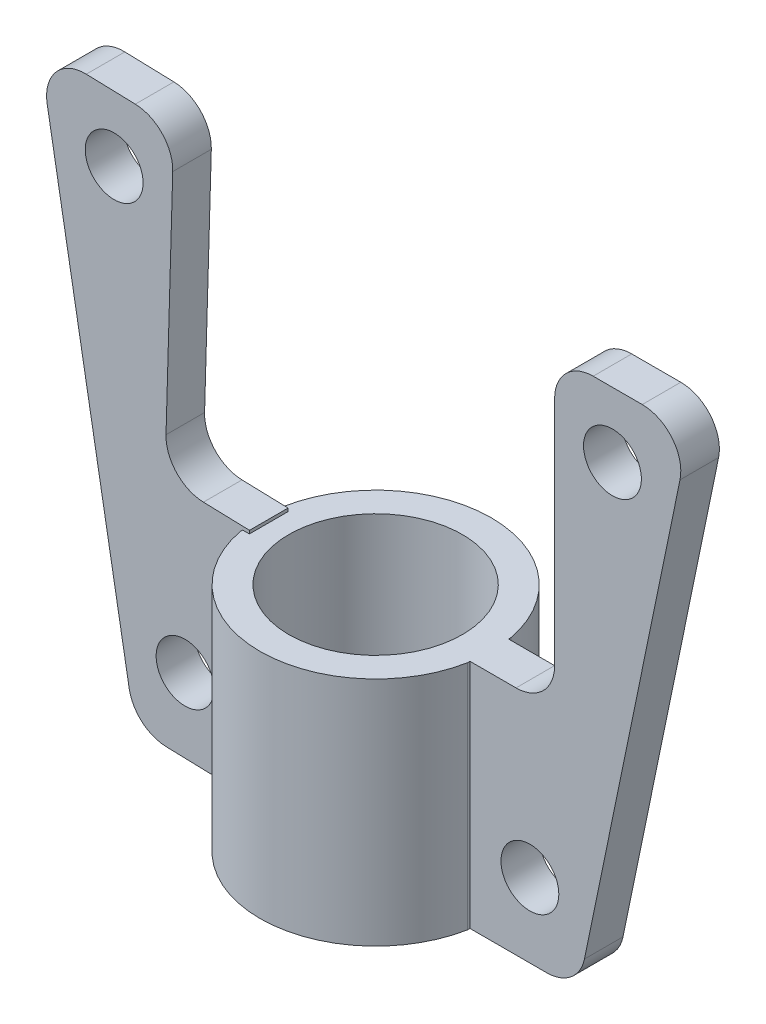
ISO-10303-21;
HEADER;
FILE_DESCRIPTION(('STEP AP214'),'2;1');
FILE_NAME('part.step','',(''),(''),'','','');
FILE_SCHEMA(('AUTOMOTIVE_DESIGN { 1 0 10303 214 1 1 1 1 }'));
ENDSEC;
DATA;
#1=APPLICATION_CONTEXT('core data for automotive mechanical design processes');
#2=APPLICATION_PROTOCOL_DEFINITION('international standard','automotive_design',2000,#1);
#3=PRODUCT_CONTEXT('',#1,'mechanical');
#4=PRODUCT('Part','Part','',(#3));
#5=PRODUCT_RELATED_PRODUCT_CATEGORY('part','',(#4));
#6=PRODUCT_DEFINITION_FORMATION('','',#4);
#7=PRODUCT_DEFINITION_CONTEXT('part definition',#1,'design');
#8=PRODUCT_DEFINITION('design','',#6,#7);
#9=PRODUCT_DEFINITION_SHAPE('','',#8);
#10=(LENGTH_UNIT() NAMED_UNIT(*) SI_UNIT(.MILLI.,.METRE.));
#11=(NAMED_UNIT(*) PLANE_ANGLE_UNIT() SI_UNIT($,.RADIAN.));
#12=(NAMED_UNIT(*) SI_UNIT($,.STERADIAN.) SOLID_ANGLE_UNIT());
#13=UNCERTAINTY_MEASURE_WITH_UNIT(LENGTH_MEASURE(1.E-05),#10,'distance_accuracy_value','');
#14=(GEOMETRIC_REPRESENTATION_CONTEXT(3) GLOBAL_UNCERTAINTY_ASSIGNED_CONTEXT((#13)) GLOBAL_UNIT_ASSIGNED_CONTEXT((#10,
#11,#12)) REPRESENTATION_CONTEXT('',''));
#15=CARTESIAN_POINT('',(0.,0.,0.));
#16=DIRECTION('',(0.,0.,1.));
#17=DIRECTION('',(1.,0.,0.));
#18=AXIS2_PLACEMENT_3D('',#15,#16,#17);
#19=CARTESIAN_POINT('',(29.4646107927976,60.,-5.64240293039713));
#20=DIRECTION('',(-1.,0.,0.));
#21=DIRECTION('',(0.,0.,1.));
#22=AXIS2_PLACEMENT_3D('',#19,#20,#21);
#23=PLANE('',#22);
#24=DIRECTION('',(0.,-1.,0.));
#25=VECTOR('',#24,1.);
#26=CARTESIAN_POINT('',(29.4646107927976,60.,5.));
#27=LINE('',#26,#25);
#28=CARTESIAN_POINT('',(29.4646107927976,60.,5.));
#29=VERTEX_POINT('',#28);
#30=CARTESIAN_POINT('',(29.4646107927976,0.,5.));
#31=VERTEX_POINT('',#30);
#32=EDGE_CURVE('E254',#29,#31,#27,.T.);
#33=ORIENTED_EDGE('',*,*,#32,.F.);
#34=DIRECTION('',(0.,0.,-1.));
#35=VECTOR('',#34,1.);
#36=CARTESIAN_POINT('',(29.4646107927976,60.,-5.64240293039713));
#37=LINE('',#36,#35);
#38=CARTESIAN_POINT('',(29.4646107927976,60.,5.64240293039713));
#39=VERTEX_POINT('',#38);
#40=EDGE_CURVE('E329',#39,#29,#37,.T.);
#41=ORIENTED_EDGE('',*,*,#40,.F.);
#42=DIRECTION('',(0.,-1.,0.));
#43=VECTOR('',#42,1.);
#44=CARTESIAN_POINT('',(29.4646107927976,60.,5.64240293039713));
#45=LINE('',#44,#43);
#46=CARTESIAN_POINT('',(29.4646107927976,0.,5.64240293039713));
#47=VERTEX_POINT('',#46);
#48=EDGE_CURVE('E354',#39,#47,#45,.T.);
#49=ORIENTED_EDGE('',*,*,#48,.T.);
#50=DIRECTION('',(0.,0.,-1.));
#51=VECTOR('',#50,1.);
#52=CARTESIAN_POINT('',(29.4646107927976,0.,-5.64240293039713));
#53=LINE('',#52,#51);
#54=EDGE_CURVE('E341',#47,#31,#53,.T.);
#55=ORIENTED_EDGE('',*,*,#54,.T.);
#56=EDGE_LOOP('',(#33,#41,#49,#55));
#57=FACE_BOUND('',#56,.T.);
#58=ADVANCED_FACE('F33',(#57),#23,.F.);
#59=CARTESIAN_POINT('',(0.,60.,0.));
#60=DIRECTION('',(0.,1.,0.));
#61=DIRECTION('',(0.,0.,1.));
#62=AXIS2_PLACEMENT_3D('',#59,#60,#61);
#63=PLANE('',#62);
#64=DIRECTION('',(1.,0.,0.));
#65=VECTOR('',#64,1.);
#66=CARTESIAN_POINT('',(0.,60.,5.));
#67=LINE('',#66,#65);
#68=CARTESIAN_POINT('',(-29.4646107927976,60.,5.));
#69=VERTEX_POINT('',#68);
#70=CARTESIAN_POINT('',(-27.730616602569,60.,5.));
#71=VERTEX_POINT('',#70);
#72=EDGE_CURVE('E231',#69,#71,#67,.T.);
#73=ORIENTED_EDGE('',*,*,#72,.F.);
#74=DIRECTION('',(0.,0.,1.));
#75=VECTOR('',#74,1.);
#76=CARTESIAN_POINT('',(-29.4646107927976,60.,-5.64240293039713));
#77=LINE('',#76,#75);
#78=CARTESIAN_POINT('',(-29.4646107927976,60.,5.64240293039713));
#79=VERTEX_POINT('',#78);
#80=EDGE_CURVE('E334',#69,#79,#77,.T.);
#81=ORIENTED_EDGE('',*,*,#80,.T.);
#82=CARTESIAN_POINT('',(0.,60.,0.));
#83=DIRECTION('',(0.,1.,0.));
#84=DIRECTION('',(0.,0.,1.));
#85=AXIS2_PLACEMENT_3D('',#82,#83,#84);
#86=CIRCLE('',#85,30.);
#87=EDGE_CURVE('E324',#79,#39,#86,.T.);
#88=ORIENTED_EDGE('',*,*,#87,.T.);
#89=ORIENTED_EDGE('',*,*,#40,.T.);
#90=DIRECTION('',(-1.,0.,0.));
#91=VECTOR('',#90,1.);
#92=CARTESIAN_POINT('',(41.4118199360627,60.,5.));
#93=LINE('',#92,#91);
#94=CARTESIAN_POINT('',(41.4118199360627,60.,5.));
#95=VERTEX_POINT('',#94);
#96=EDGE_CURVE('E251',#95,#29,#93,.T.);
#97=ORIENTED_EDGE('',*,*,#96,.F.);
#98=DIRECTION('',(0.,0.,-1.));
#99=VECTOR('',#98,1.);
#100=CARTESIAN_POINT('',(41.4118199360627,60.,5.));
#101=LINE('',#100,#99);
#102=CARTESIAN_POINT('',(41.4118199360627,60.,-5.));
#103=VERTEX_POINT('',#102);
#104=EDGE_CURVE('E274',#95,#103,#101,.T.);
#105=ORIENTED_EDGE('',*,*,#104,.T.);
#106=DIRECTION('',(-1.,0.,0.));
#107=VECTOR('',#106,1.);
#108=CARTESIAN_POINT('',(41.4118199360627,60.,-5.));
#109=LINE('',#108,#107);
#110=CARTESIAN_POINT('',(29.4646107927976,60.,-5.));
#111=VERTEX_POINT('',#110);
#112=EDGE_CURVE('E248',#103,#111,#109,.T.);
#113=ORIENTED_EDGE('',*,*,#112,.T.);
#114=CARTESIAN_POINT('',(29.4646107927976,60.,-5.64240293039713));
#115=VERTEX_POINT('',#114);
#116=EDGE_CURVE('E327',#111,#115,#37,.T.);
#117=ORIENTED_EDGE('',*,*,#116,.T.);
#118=CARTESIAN_POINT('',(0.,60.,0.));
#119=DIRECTION('',(0.,1.,0.));
#120=DIRECTION('',(0.,0.,1.));
#121=AXIS2_PLACEMENT_3D('',#118,#119,#120);
#122=CIRCLE('',#121,30.);
#123=CARTESIAN_POINT('',(-29.4646107927976,60.,-5.64240293039715));
#124=VERTEX_POINT('',#123);
#125=EDGE_CURVE('E332',#115,#124,#122,.T.);
#126=ORIENTED_EDGE('',*,*,#125,.T.);
#127=CARTESIAN_POINT('',(-29.4646107927976,60.,-5.));
#128=VERTEX_POINT('',#127);
#129=EDGE_CURVE('E335',#124,#128,#77,.T.);
#130=ORIENTED_EDGE('',*,*,#129,.T.);
#131=DIRECTION('',(1.,0.,0.));
#132=VECTOR('',#131,1.);
#133=CARTESIAN_POINT('',(0.,60.,-5.));
#134=LINE('',#133,#132);
#135=CARTESIAN_POINT('',(-27.730616602569,60.,-5.));
#136=VERTEX_POINT('',#135);
#137=EDGE_CURVE('E51',#128,#136,#134,.T.);
#138=ORIENTED_EDGE('',*,*,#137,.T.);
#139=DIRECTION('',(0.,0.,1.));
#140=VECTOR('',#139,1.);
#141=CARTESIAN_POINT('',(-27.730616602569,60.,0.));
#142=LINE('',#141,#140);
#143=EDGE_CURVE('E11',#136,#71,#142,.T.);
#144=ORIENTED_EDGE('',*,*,#143,.T.);
#145=EDGE_LOOP('',(#73,#81,#88,#89,#97,#105,#113,#117,#126,#130,#138,#144));
#146=FACE_BOUND('',#145,.T.);
#147=CARTESIAN_POINT('',(0.,60.,0.));
#148=DIRECTION('',(0.,1.,0.));
#149=DIRECTION('',(0.,0.,1.));
#150=AXIS2_PLACEMENT_3D('',#147,#148,#149);
#151=CIRCLE('',#150,22.5);
#152=CARTESIAN_POINT('',(0.,60.,22.5));
#153=VERTEX_POINT('',#152);
#154=EDGE_CURVE('E318',#153,#153,#151,.T.);
#155=ORIENTED_EDGE('',*,*,#154,.F.);
#156=EDGE_LOOP('',(#155));
#157=FACE_BOUND('',#156,.T.);
#158=ADVANCED_FACE('F452',(#146,#157),#63,.T.);
#159=CARTESIAN_POINT('',(0.,0.,0.));
#160=DIRECTION('',(0.,1.,0.));
#161=DIRECTION('',(0.,0.,1.));
#162=AXIS2_PLACEMENT_3D('',#159,#160,#161);
#163=PLANE('',#162);
#164=CARTESIAN_POINT('',(0.,0.,0.));
#165=DIRECTION('',(0.,1.,0.));
#166=DIRECTION('',(0.,0.,1.));
#167=AXIS2_PLACEMENT_3D('',#164,#165,#166);
#168=CIRCLE('',#167,30.);
#169=CARTESIAN_POINT('',(-29.4646107927976,0.,5.64240293039713));
#170=VERTEX_POINT('',#169);
#171=EDGE_CURVE('E321',#170,#47,#168,.T.);
#172=ORIENTED_EDGE('',*,*,#171,.F.);
#173=DIRECTION('',(0.,0.,1.));
#174=VECTOR('',#173,1.);
#175=CARTESIAN_POINT('',(-29.4646107927976,0.,-5.64240293039713));
#176=LINE('',#175,#174);
#177=CARTESIAN_POINT('',(-29.4646107927976,0.,-5.64240293039715));
#178=VERTEX_POINT('',#177);
#179=EDGE_CURVE('E328',#178,#170,#176,.T.);
#180=ORIENTED_EDGE('',*,*,#179,.F.);
#181=CARTESIAN_POINT('',(0.,0.,0.));
#182=DIRECTION('',(0.,1.,0.));
#183=DIRECTION('',(0.,0.,1.));
#184=AXIS2_PLACEMENT_3D('',#181,#182,#183);
#185=CIRCLE('',#184,30.);
#186=CARTESIAN_POINT('',(29.4646107927976,0.,-5.64240293039713));
#187=VERTEX_POINT('',#186);
#188=EDGE_CURVE('E343',#187,#178,#185,.T.);
#189=ORIENTED_EDGE('',*,*,#188,.F.);
#190=CARTESIAN_POINT('',(29.4646107927976,0.,-5.));
#191=VERTEX_POINT('',#190);
#192=EDGE_CURVE('E340',#191,#187,#53,.T.);
#193=ORIENTED_EDGE('',*,*,#192,.F.);
#194=DIRECTION('',(1.,0.,0.));
#195=VECTOR('',#194,1.);
#196=CARTESIAN_POINT('',(29.4646107927976,0.,-5.));
#197=LINE('',#196,#195);
#198=CARTESIAN_POINT('',(49.35985819664,0.,-5.));
#199=VERTEX_POINT('',#198);
#200=EDGE_CURVE('E279',#191,#199,#197,.T.);
#201=ORIENTED_EDGE('',*,*,#200,.T.);
#202=DIRECTION('',(0.,0.,-1.));
#203=VECTOR('',#202,1.);
#204=CARTESIAN_POINT('',(49.35985819664,0.,5.));
#205=LINE('',#204,#203);
#206=CARTESIAN_POINT('',(49.35985819664,0.,5.));
#207=VERTEX_POINT('',#206);
#208=EDGE_CURVE('E314',#207,#199,#205,.T.);
#209=ORIENTED_EDGE('',*,*,#208,.F.);
#210=DIRECTION('',(1.,0.,0.));
#211=VECTOR('',#210,1.);
#212=CARTESIAN_POINT('',(29.4646107927976,0.,5.));
#213=LINE('',#212,#211);
#214=EDGE_CURVE('E258',#31,#207,#213,.T.);
#215=ORIENTED_EDGE('',*,*,#214,.F.);
#216=ORIENTED_EDGE('',*,*,#54,.F.);
#217=EDGE_LOOP('',(#172,#180,#189,#193,#201,#209,#215,#216));
#218=FACE_BOUND('',#217,.T.);
#219=CARTESIAN_POINT('',(0.,0.,0.));
#220=DIRECTION('',(0.,1.,0.));
#221=DIRECTION('',(0.,0.,1.));
#222=AXIS2_PLACEMENT_3D('',#219,#220,#221);
#223=CIRCLE('',#222,22.5);
#224=CARTESIAN_POINT('',(0.,0.,22.5));
#225=VERTEX_POINT('',#224);
#226=EDGE_CURVE('E317',#225,#225,#223,.T.);
#227=ORIENTED_EDGE('',*,*,#226,.T.);
#228=EDGE_LOOP('',(#227));
#229=FACE_BOUND('',#228,.T.);
#230=ADVANCED_FACE('F458',(#218,#229),#163,.F.);
#231=CARTESIAN_POINT('',(0.,60.,0.));
#232=DIRECTION('',(0.,-1.,0.));
#233=DIRECTION('',(0.,0.,-1.));
#234=AXIS2_PLACEMENT_3D('',#231,#232,#233);
#235=CYLINDRICAL_SURFACE('',#234,30.);
#236=ORIENTED_EDGE('',*,*,#171,.T.);
#237=ORIENTED_EDGE('',*,*,#48,.F.);
#238=ORIENTED_EDGE('',*,*,#87,.F.);
#239=DIRECTION('',(0.,-1.,0.));
#240=VECTOR('',#239,1.);
#241=CARTESIAN_POINT('',(-29.4646107927976,60.,5.64240293039713));
#242=LINE('',#241,#240);
#243=EDGE_CURVE('E337',#79,#170,#242,.T.);
#244=ORIENTED_EDGE('',*,*,#243,.T.);
#245=EDGE_LOOP('',(#236,#237,#238,#244));
#246=FACE_BOUND('',#245,.T.);
#247=ADVANCED_FACE('F35',(#246),#235,.T.);
#248=ORIENTED_EDGE('',*,*,#116,.F.);
#249=DIRECTION('',(0.,-1.,0.));
#250=VECTOR('',#249,1.);
#251=CARTESIAN_POINT('',(29.4646107927976,60.,-5.));
#252=LINE('',#251,#250);
#253=EDGE_CURVE('E277',#111,#191,#252,.T.);
#254=ORIENTED_EDGE('',*,*,#253,.T.);
#255=ORIENTED_EDGE('',*,*,#192,.T.);
#256=DIRECTION('',(0.,-1.,0.));
#257=VECTOR('',#256,1.);
#258=CARTESIAN_POINT('',(29.4646107927976,60.,-5.64240293039713));
#259=LINE('',#258,#257);
#260=EDGE_CURVE('E351',#115,#187,#259,.T.);
#261=ORIENTED_EDGE('',*,*,#260,.F.);
#262=EDGE_LOOP('',(#248,#254,#255,#261));
#263=FACE_BOUND('',#262,.T.);
#264=ADVANCED_FACE('F454',(#263),#23,.F.);
#265=CARTESIAN_POINT('',(0.,60.,0.));
#266=DIRECTION('',(0.,-1.,0.));
#267=DIRECTION('',(0.,0.,-1.));
#268=AXIS2_PLACEMENT_3D('',#265,#266,#267);
#269=CYLINDRICAL_SURFACE('',#268,30.);
#270=ORIENTED_EDGE('',*,*,#188,.T.);
#271=DIRECTION('',(0.,-1.,0.));
#272=VECTOR('',#271,1.);
#273=CARTESIAN_POINT('',(-29.4646107927976,60.,-5.64240293039715));
#274=LINE('',#273,#272);
#275=EDGE_CURVE('E348',#124,#178,#274,.T.);
#276=ORIENTED_EDGE('',*,*,#275,.F.);
#277=ORIENTED_EDGE('',*,*,#125,.F.);
#278=ORIENTED_EDGE('',*,*,#260,.T.);
#279=EDGE_LOOP('',(#270,#276,#277,#278));
#280=FACE_BOUND('',#279,.T.);
#281=ADVANCED_FACE('F462',(#280),#269,.T.);
#282=CARTESIAN_POINT('',(-29.4646107927976,60.,-5.64240293039713));
#283=DIRECTION('',(1.,0.,0.));
#284=DIRECTION('',(0.,0.,-1.));
#285=AXIS2_PLACEMENT_3D('',#282,#283,#284);
#286=PLANE('',#285);
#287=ORIENTED_EDGE('',*,*,#80,.F.);
#288=DIRECTION('',(0.,-1.,0.));
#289=VECTOR('',#288,1.);
#290=CARTESIAN_POINT('',(-29.4646107927976,60.,5.));
#291=LINE('',#290,#289);
#292=CARTESIAN_POINT('',(-29.4646107927976,0.857652837614718,5.));
#293=VERTEX_POINT('',#292);
#294=EDGE_CURVE('E41',#69,#293,#291,.T.);
#295=ORIENTED_EDGE('',*,*,#294,.T.);
#296=DIRECTION('',(0.,0.,1.));
#297=VECTOR('',#296,1.);
#298=CARTESIAN_POINT('',(-29.4646107927976,0.857652837614721,-5.64240293039713));
#299=LINE('',#298,#297);
#300=CARTESIAN_POINT('',(-29.4646107927976,0.857652837614721,-5.));
#301=VERTEX_POINT('',#300);
#302=EDGE_CURVE('E357',#301,#293,#299,.T.);
#303=ORIENTED_EDGE('',*,*,#302,.F.);
#304=DIRECTION('',(0.,-1.,0.));
#305=VECTOR('',#304,1.);
#306=CARTESIAN_POINT('',(-29.4646107927976,60.,-5.));
#307=LINE('',#306,#305);
#308=EDGE_CURVE('E360',#128,#301,#307,.T.);
#309=ORIENTED_EDGE('',*,*,#308,.F.);
#310=ORIENTED_EDGE('',*,*,#129,.F.);
#311=ORIENTED_EDGE('',*,*,#275,.T.);
#312=ORIENTED_EDGE('',*,*,#179,.T.);
#313=ORIENTED_EDGE('',*,*,#243,.F.);
#314=EDGE_LOOP('',(#287,#295,#303,#309,#310,#311,#312,#313));
#315=FACE_BOUND('',#314,.T.);
#316=ADVANCED_FACE('F364',(#315),#286,.F.);
#317=CARTESIAN_POINT('',(0.,60.,0.));
#318=DIRECTION('',(0.,-1.,0.));
#319=DIRECTION('',(0.,0.,-1.));
#320=AXIS2_PLACEMENT_3D('',#317,#318,#319);
#321=CYLINDRICAL_SURFACE('',#320,22.5);
#322=ORIENTED_EDGE('',*,*,#154,.T.);
#323=EDGE_LOOP('',(#322));
#324=FACE_BOUND('',#323,.T.);
#325=ORIENTED_EDGE('',*,*,#226,.F.);
#326=EDGE_LOOP('',(#325));
#327=FACE_BOUND('',#326,.T.);
#328=ADVANCED_FACE('F541',(#324,#327),#321,.F.);
#329=CARTESIAN_POINT('',(49.3598581966398,10.,5.));
#330=DIRECTION('',(0.,0.,-1.));
#331=DIRECTION('',(-1.,0.,0.));
#332=AXIS2_PLACEMENT_3D('',#329,#330,#331);
#333=PLANE('',#332);
#334=ORIENTED_EDGE('',*,*,#96,.T.);
#335=ORIENTED_EDGE('',*,*,#32,.T.);
#336=ORIENTED_EDGE('',*,*,#214,.T.);
#337=CARTESIAN_POINT('',(49.3598581966398,10.,5.));
#338=DIRECTION('',(0.,0.,1.));
#339=DIRECTION('',(-1.,0.,0.));
#340=AXIS2_PLACEMENT_3D('',#337,#338,#339);
#341=CIRCLE('',#340,10.0000000000001);
#342=CARTESIAN_POINT('',(59.1532913117499,7.97795454554887,5.));
#343=VERTEX_POINT('',#342);
#344=EDGE_CURVE('E260',#207,#343,#341,.T.);
#345=ORIENTED_EDGE('',*,*,#344,.T.);
#346=DIRECTION('',(0.202204545445117,0.979343311511001,0.));
#347=VECTOR('',#346,1.);
#348=CARTESIAN_POINT('',(59.15329131175,7.97795454554883,5.));
#349=LINE('',#348,#347);
#350=CARTESIAN_POINT('',(83.9296339570854,127.977954545549,5.));
#351=VERTEX_POINT('',#350);
#352=EDGE_CURVE('E262',#343,#351,#349,.T.);
#353=ORIENTED_EDGE('',*,*,#352,.T.);
#354=CARTESIAN_POINT('',(74.1362008419754,130.,5.));
#355=DIRECTION('',(0.,0.,1.));
#356=DIRECTION('',(1.,0.,0.));
#357=AXIS2_PLACEMENT_3D('',#354,#355,#356);
#358=CIRCLE('',#357,10.);
#359=CARTESIAN_POINT('',(74.1362008419753,140.,5.));
#360=VERTEX_POINT('',#359);
#361=EDGE_CURVE('E264',#351,#360,#358,.T.);
#362=ORIENTED_EDGE('',*,*,#361,.T.);
#363=DIRECTION('',(-1.,0.,0.));
#364=VECTOR('',#363,1.);
#365=CARTESIAN_POINT('',(74.1362008419753,140.,5.));
#366=LINE('',#365,#364);
#367=CARTESIAN_POINT('',(61.4118199360628,140.,5.));
#368=VERTEX_POINT('',#367);
#369=EDGE_CURVE('E266',#360,#368,#366,.T.);
#370=ORIENTED_EDGE('',*,*,#369,.T.);
#371=CARTESIAN_POINT('',(61.4118199360628,130.,5.));
#372=DIRECTION('',(0.,0.,1.));
#373=DIRECTION('',(-1.,0.,0.));
#374=AXIS2_PLACEMENT_3D('',#371,#372,#373);
#375=CIRCLE('',#374,10.);
#376=CARTESIAN_POINT('',(51.4118199360628,130.,5.));
#377=VERTEX_POINT('',#376);
#378=EDGE_CURVE('E268',#368,#377,#375,.T.);
#379=ORIENTED_EDGE('',*,*,#378,.T.);
#380=DIRECTION('',(0.,-1.,0.));
#381=VECTOR('',#380,1.);
#382=CARTESIAN_POINT('',(51.4118199360628,130.,5.));
#383=LINE('',#382,#381);
#384=CARTESIAN_POINT('',(51.4118199360628,70.0000000000001,5.));
#385=VERTEX_POINT('',#384);
#386=EDGE_CURVE('E270',#377,#385,#383,.T.);
#387=ORIENTED_EDGE('',*,*,#386,.T.);
#388=CARTESIAN_POINT('',(41.4118199360628,70.,5.));
#389=DIRECTION('',(0.,0.,-1.));
#390=DIRECTION('',(1.,0.,0.));
#391=AXIS2_PLACEMENT_3D('',#388,#389,#390);
#392=CIRCLE('',#391,10.);
#393=EDGE_CURVE('E272',#385,#95,#392,.T.);
#394=ORIENTED_EDGE('',*,*,#393,.T.);
#395=EDGE_LOOP('',(#334,#335,#336,#345,#353,#362,#370,#379,#387,#394));
#396=FACE_BOUND('',#395,.T.);
#397=CARTESIAN_POINT('',(45.,19.2035641654874,5.));
#398=DIRECTION('',(0.,0.,1.));
#399=DIRECTION('',(1.,0.,0.));
#400=AXIS2_PLACEMENT_3D('',#397,#398,#399);
#401=CIRCLE('',#400,7.5);
#402=CARTESIAN_POINT('',(52.5,19.2035641654874,5.));
#403=VERTEX_POINT('',#402);
#404=EDGE_CURVE('E245',#403,#403,#401,.T.);
#405=ORIENTED_EDGE('',*,*,#404,.F.);
#406=EDGE_LOOP('',(#405));
#407=FACE_BOUND('',#406,.T.);
#408=CARTESIAN_POINT('',(66.4118199360613,123.151797879511,5.));
#409=DIRECTION('',(0.,0.,1.));
#410=DIRECTION('',(-1.,0.,0.));
#411=AXIS2_PLACEMENT_3D('',#408,#409,#410);
#412=CIRCLE('',#411,7.49999999999999);
#413=CARTESIAN_POINT('',(58.9118199360613,123.151797879511,5.));
#414=VERTEX_POINT('',#413);
#415=EDGE_CURVE('E239',#414,#414,#412,.T.);
#416=ORIENTED_EDGE('',*,*,#415,.F.);
#417=EDGE_LOOP('',(#416));
#418=FACE_BOUND('',#417,.T.);
#419=ADVANCED_FACE('F538',(#396,#407,#418),#333,.F.);
#420=CARTESIAN_POINT('',(49.3598581966398,10.,-5.));
#421=DIRECTION('',(0.,0.,-1.));
#422=DIRECTION('',(-1.,0.,0.));
#423=AXIS2_PLACEMENT_3D('',#420,#421,#422);
#424=PLANE('',#423);
#425=CARTESIAN_POINT('',(45.,19.2035641654874,-5.));
#426=DIRECTION('',(0.,0.,1.));
#427=DIRECTION('',(1.,0.,0.));
#428=AXIS2_PLACEMENT_3D('',#425,#426,#427);
#429=CIRCLE('',#428,7.5);
#430=CARTESIAN_POINT('',(52.5,19.2035641654874,-5.));
#431=VERTEX_POINT('',#430);
#432=EDGE_CURVE('E242',#431,#431,#429,.T.);
#433=ORIENTED_EDGE('',*,*,#432,.T.);
#434=EDGE_LOOP('',(#433));
#435=FACE_BOUND('',#434,.T.);
#436=ORIENTED_EDGE('',*,*,#112,.F.);
#437=CARTESIAN_POINT('',(41.4118199360628,70.,-5.));
#438=DIRECTION('',(0.,0.,-1.));
#439=DIRECTION('',(1.,0.,0.));
#440=AXIS2_PLACEMENT_3D('',#437,#438,#439);
#441=CIRCLE('',#440,10.);
#442=CARTESIAN_POINT('',(51.4118199360628,70.0000000000001,-5.));
#443=VERTEX_POINT('',#442);
#444=EDGE_CURVE('E255',#443,#103,#441,.T.);
#445=ORIENTED_EDGE('',*,*,#444,.F.);
#446=DIRECTION('',(0.,-1.,0.));
#447=VECTOR('',#446,1.);
#448=CARTESIAN_POINT('',(51.4118199360628,130.,-5.));
#449=LINE('',#448,#447);
#450=CARTESIAN_POINT('',(51.4118199360628,130.,-5.));
#451=VERTEX_POINT('',#450);
#452=EDGE_CURVE('E291',#451,#443,#449,.T.);
#453=ORIENTED_EDGE('',*,*,#452,.F.);
#454=CARTESIAN_POINT('',(61.4118199360628,130.,-5.));
#455=DIRECTION('',(0.,0.,1.));
#456=DIRECTION('',(-1.,0.,0.));
#457=AXIS2_PLACEMENT_3D('',#454,#455,#456);
#458=CIRCLE('',#457,10.);
#459=CARTESIAN_POINT('',(61.4118199360628,140.,-5.));
#460=VERTEX_POINT('',#459);
#461=EDGE_CURVE('E289',#460,#451,#458,.T.);
#462=ORIENTED_EDGE('',*,*,#461,.F.);
#463=DIRECTION('',(-1.,0.,0.));
#464=VECTOR('',#463,1.);
#465=CARTESIAN_POINT('',(74.1362008419753,140.,-5.));
#466=LINE('',#465,#464);
#467=CARTESIAN_POINT('',(74.1362008419753,140.,-5.));
#468=VERTEX_POINT('',#467);
#469=EDGE_CURVE('E287',#468,#460,#466,.T.);
#470=ORIENTED_EDGE('',*,*,#469,.F.);
#471=CARTESIAN_POINT('',(74.1362008419754,130.,-5.));
#472=DIRECTION('',(0.,0.,1.));
#473=DIRECTION('',(1.,0.,0.));
#474=AXIS2_PLACEMENT_3D('',#471,#472,#473);
#475=CIRCLE('',#474,10.);
#476=CARTESIAN_POINT('',(83.9296339570854,127.977954545549,-5.));
#477=VERTEX_POINT('',#476);
#478=EDGE_CURVE('E285',#477,#468,#475,.T.);
#479=ORIENTED_EDGE('',*,*,#478,.F.);
#480=DIRECTION('',(0.202204545445117,0.979343311511001,0.));
#481=VECTOR('',#480,1.);
#482=CARTESIAN_POINT('',(59.15329131175,7.97795454554883,-5.));
#483=LINE('',#482,#481);
#484=CARTESIAN_POINT('',(59.1532913117499,7.97795454554887,-5.));
#485=VERTEX_POINT('',#484);
#486=EDGE_CURVE('E283',#485,#477,#483,.T.);
#487=ORIENTED_EDGE('',*,*,#486,.F.);
#488=CARTESIAN_POINT('',(49.3598581966398,10.,-5.));
#489=DIRECTION('',(0.,0.,1.));
#490=DIRECTION('',(-1.,0.,0.));
#491=AXIS2_PLACEMENT_3D('',#488,#489,#490);
#492=CIRCLE('',#491,10.0000000000001);
#493=EDGE_CURVE('E281',#199,#485,#492,.T.);
#494=ORIENTED_EDGE('',*,*,#493,.F.);
#495=ORIENTED_EDGE('',*,*,#200,.F.);
#496=ORIENTED_EDGE('',*,*,#253,.F.);
#497=EDGE_LOOP('',(#436,#445,#453,#462,#470,#479,#487,#494,#495,#496));
#498=FACE_BOUND('',#497,.T.);
#499=CARTESIAN_POINT('',(66.4118199360613,123.151797879511,-5.));
#500=DIRECTION('',(0.,0.,1.));
#501=DIRECTION('',(-1.,0.,0.));
#502=AXIS2_PLACEMENT_3D('',#499,#500,#501);
#503=CIRCLE('',#502,7.49999999999999);
#504=CARTESIAN_POINT('',(58.9118199360613,123.151797879511,-5.));
#505=VERTEX_POINT('',#504);
#506=EDGE_CURVE('E238',#505,#505,#503,.T.);
#507=ORIENTED_EDGE('',*,*,#506,.T.);
#508=EDGE_LOOP('',(#507));
#509=FACE_BOUND('',#508,.T.);
#510=ADVANCED_FACE('F477',(#435,#498,#509),#424,.T.);
#511=CARTESIAN_POINT('',(49.3598581966398,10.,5.));
#512=DIRECTION('',(0.,0.,-1.));
#513=DIRECTION('',(-1.,0.,0.));
#514=AXIS2_PLACEMENT_3D('',#511,#512,#513);
#515=CYLINDRICAL_SURFACE('',#514,10.0000000000001);
#516=ORIENTED_EDGE('',*,*,#493,.T.);
#517=DIRECTION('',(0.,0.,-1.));
#518=VECTOR('',#517,1.);
#519=CARTESIAN_POINT('',(59.1532913117499,7.97795454554887,5.));
#520=LINE('',#519,#518);
#521=EDGE_CURVE('E311',#343,#485,#520,.T.);
#522=ORIENTED_EDGE('',*,*,#521,.F.);
#523=ORIENTED_EDGE('',*,*,#344,.F.);
#524=ORIENTED_EDGE('',*,*,#208,.T.);
#525=EDGE_LOOP('',(#516,#522,#523,#524));
#526=FACE_BOUND('',#525,.T.);
#527=ADVANCED_FACE('F515',(#526),#515,.T.);
#528=CARTESIAN_POINT('',(59.15329131175,7.97795454554883,5.));
#529=DIRECTION('',(-0.979343311511001,0.202204545445117,0.));
#530=DIRECTION('',(-0.202204545445117,-0.979343311511001,0.));
#531=AXIS2_PLACEMENT_3D('',#528,#529,#530);
#532=PLANE('',#531);
#533=ORIENTED_EDGE('',*,*,#486,.T.);
#534=DIRECTION('',(0.,0.,-1.));
#535=VECTOR('',#534,1.);
#536=CARTESIAN_POINT('',(83.9296339570854,127.977954545549,5.));
#537=LINE('',#536,#535);
#538=EDGE_CURVE('E308',#351,#477,#537,.T.);
#539=ORIENTED_EDGE('',*,*,#538,.F.);
#540=ORIENTED_EDGE('',*,*,#352,.F.);
#541=ORIENTED_EDGE('',*,*,#521,.T.);
#542=EDGE_LOOP('',(#533,#539,#540,#541));
#543=FACE_BOUND('',#542,.T.);
#544=ADVANCED_FACE('F511',(#543),#532,.F.);
#545=CARTESIAN_POINT('',(74.1362008419754,130.,5.));
#546=DIRECTION('',(0.,0.,-1.));
#547=DIRECTION('',(-1.,0.,0.));
#548=AXIS2_PLACEMENT_3D('',#545,#546,#547);
#549=CYLINDRICAL_SURFACE('',#548,10.);
#550=ORIENTED_EDGE('',*,*,#478,.T.);
#551=DIRECTION('',(0.,0.,-1.));
#552=VECTOR('',#551,1.);
#553=CARTESIAN_POINT('',(74.1362008419753,140.,5.));
#554=LINE('',#553,#552);
#555=EDGE_CURVE('E305',#360,#468,#554,.T.);
#556=ORIENTED_EDGE('',*,*,#555,.F.);
#557=ORIENTED_EDGE('',*,*,#361,.F.);
#558=ORIENTED_EDGE('',*,*,#538,.T.);
#559=EDGE_LOOP('',(#550,#556,#557,#558));
#560=FACE_BOUND('',#559,.T.);
#561=ADVANCED_FACE('F506',(#560),#549,.T.);
#562=CARTESIAN_POINT('',(74.1362008419753,140.,5.));
#563=DIRECTION('',(0.,-1.,0.));
#564=DIRECTION('',(0.,0.,-1.));
#565=AXIS2_PLACEMENT_3D('',#562,#563,#564);
#566=PLANE('',#565);
#567=ORIENTED_EDGE('',*,*,#469,.T.);
#568=DIRECTION('',(0.,0.,-1.));
#569=VECTOR('',#568,1.);
#570=CARTESIAN_POINT('',(61.4118199360628,140.,5.));
#571=LINE('',#570,#569);
#572=EDGE_CURVE('E302',#368,#460,#571,.T.);
#573=ORIENTED_EDGE('',*,*,#572,.F.);
#574=ORIENTED_EDGE('',*,*,#369,.F.);
#575=ORIENTED_EDGE('',*,*,#555,.T.);
#576=EDGE_LOOP('',(#567,#573,#574,#575));
#577=FACE_BOUND('',#576,.T.);
#578=ADVANCED_FACE('F501',(#577),#566,.F.);
#579=CARTESIAN_POINT('',(61.4118199360628,130.,5.));
#580=DIRECTION('',(0.,0.,-1.));
#581=DIRECTION('',(-1.,0.,0.));
#582=AXIS2_PLACEMENT_3D('',#579,#580,#581);
#583=CYLINDRICAL_SURFACE('',#582,10.);
#584=ORIENTED_EDGE('',*,*,#461,.T.);
#585=DIRECTION('',(0.,0.,-1.));
#586=VECTOR('',#585,1.);
#587=CARTESIAN_POINT('',(51.4118199360628,130.,5.));
#588=LINE('',#587,#586);
#589=EDGE_CURVE('E299',#377,#451,#588,.T.);
#590=ORIENTED_EDGE('',*,*,#589,.F.);
#591=ORIENTED_EDGE('',*,*,#378,.F.);
#592=ORIENTED_EDGE('',*,*,#572,.T.);
#593=EDGE_LOOP('',(#584,#590,#591,#592));
#594=FACE_BOUND('',#593,.T.);
#595=ADVANCED_FACE('F497',(#594),#583,.T.);
#596=CARTESIAN_POINT('',(51.4118199360628,130.,5.));
#597=DIRECTION('',(1.,0.,0.));
#598=DIRECTION('',(0.,1.,0.));
#599=AXIS2_PLACEMENT_3D('',#596,#597,#598);
#600=PLANE('',#599);
#601=ORIENTED_EDGE('',*,*,#452,.T.);
#602=DIRECTION('',(0.,0.,-1.));
#603=VECTOR('',#602,1.);
#604=CARTESIAN_POINT('',(51.4118199360628,70.0000000000001,5.));
#605=LINE('',#604,#603);
#606=EDGE_CURVE('E296',#385,#443,#605,.T.);
#607=ORIENTED_EDGE('',*,*,#606,.F.);
#608=ORIENTED_EDGE('',*,*,#386,.F.);
#609=ORIENTED_EDGE('',*,*,#589,.T.);
#610=EDGE_LOOP('',(#601,#607,#608,#609));
#611=FACE_BOUND('',#610,.T.);
#612=ADVANCED_FACE('F492',(#611),#600,.F.);
#613=CARTESIAN_POINT('',(41.4118199360628,70.,5.));
#614=DIRECTION('',(0.,0.,-1.));
#615=DIRECTION('',(-1.,0.,0.));
#616=AXIS2_PLACEMENT_3D('',#613,#614,#615);
#617=CYLINDRICAL_SURFACE('',#616,10.);
#618=ORIENTED_EDGE('',*,*,#444,.T.);
#619=ORIENTED_EDGE('',*,*,#104,.F.);
#620=ORIENTED_EDGE('',*,*,#393,.F.);
#621=ORIENTED_EDGE('',*,*,#606,.T.);
#622=EDGE_LOOP('',(#618,#619,#620,#621));
#623=FACE_BOUND('',#622,.T.);
#624=ADVANCED_FACE('F486',(#623),#617,.F.);
#625=CARTESIAN_POINT('',(45.,19.2035641654874,5.));
#626=DIRECTION('',(0.,0.,-1.));
#627=DIRECTION('',(-1.,0.,0.));
#628=AXIS2_PLACEMENT_3D('',#625,#626,#627);
#629=CYLINDRICAL_SURFACE('',#628,7.5);
#630=ORIENTED_EDGE('',*,*,#404,.T.);
#631=EDGE_LOOP('',(#630));
#632=FACE_BOUND('',#631,.T.);
#633=ORIENTED_EDGE('',*,*,#432,.F.);
#634=EDGE_LOOP('',(#633));
#635=FACE_BOUND('',#634,.T.);
#636=ADVANCED_FACE('F550',(#632,#635),#629,.F.);
#637=CARTESIAN_POINT('',(66.4118199360613,123.151797879511,5.));
#638=DIRECTION('',(0.,0.,-1.));
#639=DIRECTION('',(-1.,0.,0.));
#640=AXIS2_PLACEMENT_3D('',#637,#638,#639);
#641=CYLINDRICAL_SURFACE('',#640,7.49999999999999);
#642=ORIENTED_EDGE('',*,*,#415,.T.);
#643=EDGE_LOOP('',(#642));
#644=FACE_BOUND('',#643,.T.);
#645=ORIENTED_EDGE('',*,*,#506,.F.);
#646=EDGE_LOOP('',(#645));
#647=FACE_BOUND('',#646,.T.);
#648=ADVANCED_FACE('F547',(#644,#647),#641,.F.);
#649=CARTESIAN_POINT('',(-29.4521364841049,0.857289736729972,5.));
#650=DIRECTION('',(0.0290955730845604,0.999576634194138,0.));
#651=DIRECTION('',(-0.999576634194138,0.0290955730845604,0.));
#652=AXIS2_PLACEMENT_3D('',#649,#650,#651);
#653=PLANE('',#652);
#654=DIRECTION('',(0.999576634194138,-0.0290955730845604,0.));
#655=VECTOR('',#654,1.);
#656=CARTESIAN_POINT('',(-29.4521364841049,0.857289736729972,-5.));
#657=LINE('',#656,#655);
#658=CARTESIAN_POINT('',(-49.3389609204974,1.43615336160388,-5.));
#659=VERTEX_POINT('',#658);
#660=EDGE_CURVE('E374',#659,#301,#657,.T.);
#661=ORIENTED_EDGE('',*,*,#660,.T.);
#662=ORIENTED_EDGE('',*,*,#302,.T.);
#663=DIRECTION('',(0.999576634194138,-0.0290955730845604,0.));
#664=VECTOR('',#663,1.);
#665=CARTESIAN_POINT('',(-29.4521364841049,0.857289736729972,5.));
#666=LINE('',#665,#664);
#667=CARTESIAN_POINT('',(-49.3389609204974,1.43615336160388,5.));
#668=VERTEX_POINT('',#667);
#669=EDGE_CURVE('E372',#668,#293,#666,.T.);
#670=ORIENTED_EDGE('',*,*,#669,.F.);
#671=DIRECTION('',(0.,0.,-1.));
#672=VECTOR('',#671,1.);
#673=CARTESIAN_POINT('',(-49.3389609204974,1.43615336160388,5.));
#674=LINE('',#673,#672);
#675=EDGE_CURVE('E419',#668,#659,#674,.T.);
#676=ORIENTED_EDGE('',*,*,#675,.T.);
#677=EDGE_LOOP('',(#661,#662,#670,#676));
#678=FACE_BOUND('',#677,.T.);
#679=ADVANCED_FACE('F370',(#678),#653,.F.);
#680=CARTESIAN_POINT('',(-57.6033957704333,131.731774540443,5.));
#681=DIRECTION('',(0.,0.,1.));
#682=DIRECTION('',(1.,0.,0.));
#683=AXIS2_PLACEMENT_3D('',#680,#681,#682);
#684=PLANE('',#683);
#685=CARTESIAN_POINT('',(-62.800531306697,125.031949579986,5.));
#686=DIRECTION('',(0.,0.,1.));
#687=DIRECTION('',(1.,0.,0.));
#688=AXIS2_PLACEMENT_3D('',#685,#686,#687);
#689=CIRCLE('',#688,7.5);
#690=CARTESIAN_POINT('',(-55.300531306697,125.031949579986,5.));
#691=VERTEX_POINT('',#690);
#692=EDGE_CURVE('E393',#691,#691,#689,.T.);
#693=ORIENTED_EDGE('',*,*,#692,.F.);
#694=EDGE_LOOP('',(#693));
#695=FACE_BOUND('',#694,.T.);
#696=ORIENTED_EDGE('',*,*,#294,.F.);
#697=ORIENTED_EDGE('',*,*,#72,.T.);
#698=DIRECTION('',(0.0290955730845605,0.999576634194138,0.));
#699=VECTOR('',#698,1.);
#700=CARTESIAN_POINT('',(-27.7064020990313,60.8318877883782,5.));
#701=LINE('',#700,#699);
#702=CARTESIAN_POINT('',(-27.7064020990313,60.8318877883782,5.));
#703=VERTEX_POINT('',#702);
#704=EDGE_CURVE('E378',#71,#703,#701,.T.);
#705=ORIENTED_EDGE('',*,*,#704,.T.);
#706=DIRECTION('',(-0.999576634194138,0.0290955730845601,0.));
#707=VECTOR('',#706,1.);
#708=CARTESIAN_POINT('',(-39.6485532024697,61.1794986851626,5.));
#709=LINE('',#708,#707);
#710=CARTESIAN_POINT('',(-39.6485532024697,61.1794986851626,5.));
#711=VERTEX_POINT('',#710);
#712=EDGE_CURVE('E380',#703,#711,#709,.T.);
#713=ORIENTED_EDGE('',*,*,#712,.T.);
#714=CARTESIAN_POINT('',(-39.3575974716241,71.175265027104,5.));
#715=DIRECTION('',(0.,0.,-1.));
#716=DIRECTION('',(-1.,0.,0.));
#717=AXIS2_PLACEMENT_3D('',#714,#715,#716);
#718=CIRCLE('',#717,10.);
#719=CARTESIAN_POINT('',(-49.3533638135655,71.4662207579497,5.));
#720=VERTEX_POINT('',#719);
#721=EDGE_CURVE('E387',#711,#720,#718,.T.);
#722=ORIENTED_EDGE('',*,*,#721,.T.);
#723=DIRECTION('',(0.0290955730845607,0.999576634194138,0.));
#724=VECTOR('',#723,1.);
#725=CARTESIAN_POINT('',(-47.6076294284919,131.440818809598,5.));
#726=LINE('',#725,#724);
#727=CARTESIAN_POINT('',(-47.6076294284919,131.440818809598,5.));
#728=VERTEX_POINT('',#727);
#729=EDGE_CURVE('E221',#720,#728,#726,.T.);
#730=ORIENTED_EDGE('',*,*,#729,.T.);
#731=CARTESIAN_POINT('',(-57.6033957704333,131.731774540443,5.));
#732=DIRECTION('',(0.,0.,1.));
#733=DIRECTION('',(1.,0.,0.));
#734=AXIS2_PLACEMENT_3D('',#731,#732,#733);
#735=CIRCLE('',#734,10.);
#736=CARTESIAN_POINT('',(-57.3124400395876,141.727540882385,5.));
#737=VERTEX_POINT('',#736);
#738=EDGE_CURVE('E214',#728,#737,#735,.T.);
#739=ORIENTED_EDGE('',*,*,#738,.T.);
#740=DIRECTION('',(-0.999576634194138,0.0290955730845615,0.));
#741=VECTOR('',#740,1.);
#742=CARTESIAN_POINT('',(-70.0314338777238,142.097764036989,5.));
#743=LINE('',#742,#741);
#744=CARTESIAN_POINT('',(-70.0314338777238,142.097764036989,5.));
#745=VERTEX_POINT('',#744);
#746=EDGE_CURVE('E203',#737,#745,#743,.T.);
#747=ORIENTED_EDGE('',*,*,#746,.T.);
#748=CARTESIAN_POINT('',(-70.3223896085695,132.101997695047,5.));
#749=DIRECTION('',(0.,0.,1.));
#750=DIRECTION('',(-1.,0.,0.));
#751=AXIS2_PLACEMENT_3D('',#748,#749,#750);
#752=CIRCLE('',#751,9.99999999999998);
#753=CARTESIAN_POINT('',(-80.1705090902769,130.365753854449,5.));
#754=VERTEX_POINT('',#753);
#755=EDGE_CURVE('E213',#745,#754,#752,.T.);
#756=ORIENTED_EDGE('',*,*,#755,.T.);
#757=DIRECTION('',(0.173624384059841,-0.984811948170736,0.));
#758=VECTOR('',#757,1.);
#759=CARTESIAN_POINT('',(-58.8961246713591,9.69567586294684,5.));
#760=LINE('',#759,#758);
#761=CARTESIAN_POINT('',(-58.896124671359,9.69567586294687,5.));
#762=VERTEX_POINT('',#761);
#763=EDGE_CURVE('E382',#754,#762,#760,.T.);
#764=ORIENTED_EDGE('',*,*,#763,.T.);
#765=CARTESIAN_POINT('',(-49.0480051896515,11.4319197035453,5.));
#766=DIRECTION('',(0.,0.,1.));
#767=DIRECTION('',(1.,0.,0.));
#768=AXIS2_PLACEMENT_3D('',#765,#766,#767);
#769=CIRCLE('',#768,10.0000000000001);
#770=EDGE_CURVE('E376',#762,#668,#769,.T.);
#771=ORIENTED_EDGE('',*,*,#770,.T.);
#772=ORIENTED_EDGE('',*,*,#669,.T.);
#773=EDGE_LOOP('',(#696,#697,#705,#713,#722,#730,#739,#747,#756,#764,#771,#772));
#774=FACE_BOUND('',#773,.T.);
#775=CARTESIAN_POINT('',(-44.4222098340752,20.5047348218742,5.));
#776=DIRECTION('',(0.,0.,1.));
#777=DIRECTION('',(-1.,0.,0.));
#778=AXIS2_PLACEMENT_3D('',#775,#776,#777);
#779=CIRCLE('',#778,7.49999999999999);
#780=CARTESIAN_POINT('',(-51.9222098340752,20.5047348218742,5.));
#781=VERTEX_POINT('',#780);
#782=EDGE_CURVE('E772',#781,#781,#779,.T.);
#783=ORIENTED_EDGE('',*,*,#782,.F.);
#784=EDGE_LOOP('',(#783));
#785=FACE_BOUND('',#784,.T.);
#786=ADVANCED_FACE('F218',(#695,#774,#785),#684,.T.);
#787=CARTESIAN_POINT('',(-57.6033957704333,131.731774540443,-5.));
#788=DIRECTION('',(0.,0.,1.));
#789=DIRECTION('',(1.,0.,0.));
#790=AXIS2_PLACEMENT_3D('',#787,#788,#789);
#791=PLANE('',#790);
#792=ORIENTED_EDGE('',*,*,#137,.F.);
#793=ORIENTED_EDGE('',*,*,#308,.T.);
#794=ORIENTED_EDGE('',*,*,#660,.F.);
#795=CARTESIAN_POINT('',(-49.0480051896515,11.4319197035453,-5.));
#796=DIRECTION('',(0.,0.,1.));
#797=DIRECTION('',(1.,0.,0.));
#798=AXIS2_PLACEMENT_3D('',#795,#796,#797);
#799=CIRCLE('',#798,10.0000000000001);
#800=CARTESIAN_POINT('',(-58.896124671359,9.69567586294687,-5.));
#801=VERTEX_POINT('',#800);
#802=EDGE_CURVE('E399',#801,#659,#799,.T.);
#803=ORIENTED_EDGE('',*,*,#802,.F.);
#804=DIRECTION('',(0.173624384059841,-0.984811948170736,0.));
#805=VECTOR('',#804,1.);
#806=CARTESIAN_POINT('',(-58.8961246713591,9.69567586294684,-5.));
#807=LINE('',#806,#805);
#808=CARTESIAN_POINT('',(-80.1705090902769,130.365753854449,-5.));
#809=VERTEX_POINT('',#808);
#810=EDGE_CURVE('E397',#809,#801,#807,.T.);
#811=ORIENTED_EDGE('',*,*,#810,.F.);
#812=CARTESIAN_POINT('',(-70.3223896085695,132.101997695047,-5.));
#813=DIRECTION('',(0.,0.,1.));
#814=DIRECTION('',(-1.,0.,0.));
#815=AXIS2_PLACEMENT_3D('',#812,#813,#814);
#816=CIRCLE('',#815,9.99999999999998);
#817=CARTESIAN_POINT('',(-70.0314338777238,142.097764036989,-5.));
#818=VERTEX_POINT('',#817);
#819=EDGE_CURVE('E395',#818,#809,#816,.T.);
#820=ORIENTED_EDGE('',*,*,#819,.F.);
#821=DIRECTION('',(-0.999576634194138,0.0290955730845615,0.));
#822=VECTOR('',#821,1.);
#823=CARTESIAN_POINT('',(-70.0314338777238,142.097764036989,-5.));
#824=LINE('',#823,#822);
#825=CARTESIAN_POINT('',(-57.3124400395876,141.727540882385,-5.));
#826=VERTEX_POINT('',#825);
#827=EDGE_CURVE('E392',#826,#818,#824,.T.);
#828=ORIENTED_EDGE('',*,*,#827,.F.);
#829=CARTESIAN_POINT('',(-57.6033957704333,131.731774540443,-5.));
#830=DIRECTION('',(0.,0.,1.));
#831=DIRECTION('',(1.,0.,0.));
#832=AXIS2_PLACEMENT_3D('',#829,#830,#831);
#833=CIRCLE('',#832,10.);
#834=CARTESIAN_POINT('',(-47.6076294284919,131.440818809598,-5.));
#835=VERTEX_POINT('',#834);
#836=EDGE_CURVE('E229',#835,#826,#833,.T.);
#837=ORIENTED_EDGE('',*,*,#836,.F.);
#838=DIRECTION('',(0.0290955730845607,0.999576634194138,0.));
#839=VECTOR('',#838,1.);
#840=CARTESIAN_POINT('',(-47.6076294284919,131.440818809598,-5.));
#841=LINE('',#840,#839);
#842=CARTESIAN_POINT('',(-49.3533638135655,71.4662207579497,-5.));
#843=VERTEX_POINT('',#842);
#844=EDGE_CURVE('E225',#843,#835,#841,.T.);
#845=ORIENTED_EDGE('',*,*,#844,.F.);
#846=CARTESIAN_POINT('',(-39.3575974716241,71.175265027104,-5.));
#847=DIRECTION('',(0.,0.,-1.));
#848=DIRECTION('',(-1.,0.,0.));
#849=AXIS2_PLACEMENT_3D('',#846,#847,#848);
#850=CIRCLE('',#849,10.);
#851=CARTESIAN_POINT('',(-39.6485532024697,61.1794986851626,-5.));
#852=VERTEX_POINT('',#851);
#853=EDGE_CURVE('E406',#852,#843,#850,.T.);
#854=ORIENTED_EDGE('',*,*,#853,.F.);
#855=DIRECTION('',(-0.999576634194138,0.0290955730845601,0.));
#856=VECTOR('',#855,1.);
#857=CARTESIAN_POINT('',(-39.6485532024697,61.1794986851626,-5.));
#858=LINE('',#857,#856);
#859=CARTESIAN_POINT('',(-27.7064020990313,60.8318877883782,-5.));
#860=VERTEX_POINT('',#859);
#861=EDGE_CURVE('E404',#860,#852,#858,.T.);
#862=ORIENTED_EDGE('',*,*,#861,.F.);
#863=DIRECTION('',(0.0290955730845605,0.999576634194138,0.));
#864=VECTOR('',#863,1.);
#865=CARTESIAN_POINT('',(-27.7064020990313,60.8318877883782,-5.));
#866=LINE('',#865,#864);
#867=EDGE_CURVE('E402',#136,#860,#866,.T.);
#868=ORIENTED_EDGE('',*,*,#867,.F.);
#869=EDGE_LOOP('',(#792,#793,#794,#803,#811,#820,#828,#837,#845,#854,#862,#868));
#870=FACE_BOUND('',#869,.T.);
#871=CARTESIAN_POINT('',(-62.800531306697,125.031949579986,-5.));
#872=DIRECTION('',(0.,0.,1.));
#873=DIRECTION('',(1.,0.,0.));
#874=AXIS2_PLACEMENT_3D('',#871,#872,#873);
#875=CIRCLE('',#874,7.5);
#876=CARTESIAN_POINT('',(-55.300531306697,125.031949579986,-5.));
#877=VERTEX_POINT('',#876);
#878=EDGE_CURVE('E778',#877,#877,#875,.T.);
#879=ORIENTED_EDGE('',*,*,#878,.T.);
#880=EDGE_LOOP('',(#879));
#881=FACE_BOUND('',#880,.T.);
#882=CARTESIAN_POINT('',(-44.4222098340752,20.5047348218742,-5.));
#883=DIRECTION('',(0.,0.,1.));
#884=DIRECTION('',(-1.,0.,0.));
#885=AXIS2_PLACEMENT_3D('',#882,#883,#884);
#886=CIRCLE('',#885,7.49999999999999);
#887=CARTESIAN_POINT('',(-51.9222098340752,20.5047348218742,-5.));
#888=VERTEX_POINT('',#887);
#889=EDGE_CURVE('E775',#888,#888,#886,.T.);
#890=ORIENTED_EDGE('',*,*,#889,.T.);
#891=EDGE_LOOP('',(#890));
#892=FACE_BOUND('',#891,.T.);
#893=ADVANCED_FACE('F434',(#870,#881,#892),#791,.F.);
#894=CARTESIAN_POINT('',(-57.6033957704333,131.731774540443,5.));
#895=DIRECTION('',(0.,0.,-1.));
#896=DIRECTION('',(-1.,0.,0.));
#897=AXIS2_PLACEMENT_3D('',#894,#895,#896);
#898=CYLINDRICAL_SURFACE('',#897,10.);
#899=ORIENTED_EDGE('',*,*,#836,.T.);
#900=DIRECTION('',(0.,0.,-1.));
#901=VECTOR('',#900,1.);
#902=CARTESIAN_POINT('',(-57.3124400395876,141.727540882385,5.));
#903=LINE('',#902,#901);
#904=EDGE_CURVE('E207',#737,#826,#903,.T.);
#905=ORIENTED_EDGE('',*,*,#904,.F.);
#906=ORIENTED_EDGE('',*,*,#738,.F.);
#907=DIRECTION('',(0.,0.,-1.));
#908=VECTOR('',#907,1.);
#909=CARTESIAN_POINT('',(-47.6076294284919,131.440818809598,5.));
#910=LINE('',#909,#908);
#911=EDGE_CURVE('E390',#728,#835,#910,.T.);
#912=ORIENTED_EDGE('',*,*,#911,.T.);
#913=EDGE_LOOP('',(#899,#905,#906,#912));
#914=FACE_BOUND('',#913,.T.);
#915=ADVANCED_FACE('F227',(#914),#898,.T.);
#916=CARTESIAN_POINT('',(-70.0314338777238,142.097764036989,5.));
#917=DIRECTION('',(-0.0290955730845615,-0.999576634194138,0.));
#918=DIRECTION('',(0.999576634194138,-0.0290955730845615,0.));
#919=AXIS2_PLACEMENT_3D('',#916,#917,#918);
#920=PLANE('',#919);
#921=ORIENTED_EDGE('',*,*,#827,.T.);
#922=DIRECTION('',(0.,0.,-1.));
#923=VECTOR('',#922,1.);
#924=CARTESIAN_POINT('',(-70.0314338777238,142.097764036989,5.));
#925=LINE('',#924,#923);
#926=EDGE_CURVE('E210',#745,#818,#925,.T.);
#927=ORIENTED_EDGE('',*,*,#926,.F.);
#928=ORIENTED_EDGE('',*,*,#746,.F.);
#929=ORIENTED_EDGE('',*,*,#904,.T.);
#930=EDGE_LOOP('',(#921,#927,#928,#929));
#931=FACE_BOUND('',#930,.T.);
#932=ADVANCED_FACE('F205',(#931),#920,.F.);
#933=CARTESIAN_POINT('',(-70.3223896085695,132.101997695047,5.));
#934=DIRECTION('',(0.,0.,-1.));
#935=DIRECTION('',(-1.,0.,0.));
#936=AXIS2_PLACEMENT_3D('',#933,#934,#935);
#937=CYLINDRICAL_SURFACE('',#936,9.99999999999998);
#938=ORIENTED_EDGE('',*,*,#819,.T.);
#939=DIRECTION('',(0.,0.,-1.));
#940=VECTOR('',#939,1.);
#941=CARTESIAN_POINT('',(-80.1705090902769,130.365753854449,5.));
#942=LINE('',#941,#940);
#943=EDGE_CURVE('E233',#754,#809,#942,.T.);
#944=ORIENTED_EDGE('',*,*,#943,.F.);
#945=ORIENTED_EDGE('',*,*,#755,.F.);
#946=ORIENTED_EDGE('',*,*,#926,.T.);
#947=EDGE_LOOP('',(#938,#944,#945,#946));
#948=FACE_BOUND('',#947,.T.);
#949=ADVANCED_FACE('F448',(#948),#937,.T.);
#950=CARTESIAN_POINT('',(-58.8961246713591,9.69567586294684,5.));
#951=DIRECTION('',(0.984811948170736,0.173624384059841,0.));
#952=DIRECTION('',(-0.173624384059841,0.984811948170736,0.));
#953=AXIS2_PLACEMENT_3D('',#950,#951,#952);
#954=PLANE('',#953);
#955=ORIENTED_EDGE('',*,*,#810,.T.);
#956=DIRECTION('',(0.,0.,-1.));
#957=VECTOR('',#956,1.);
#958=CARTESIAN_POINT('',(-58.896124671359,9.69567586294687,5.));
#959=LINE('',#958,#957);
#960=EDGE_CURVE('E421',#762,#801,#959,.T.);
#961=ORIENTED_EDGE('',*,*,#960,.F.);
#962=ORIENTED_EDGE('',*,*,#763,.F.);
#963=ORIENTED_EDGE('',*,*,#943,.T.);
#964=EDGE_LOOP('',(#955,#961,#962,#963));
#965=FACE_BOUND('',#964,.T.);
#966=ADVANCED_FACE('F428',(#965),#954,.F.);
#967=CARTESIAN_POINT('',(-49.0480051896515,11.4319197035453,5.));
#968=DIRECTION('',(0.,0.,-1.));
#969=DIRECTION('',(-1.,0.,0.));
#970=AXIS2_PLACEMENT_3D('',#967,#968,#969);
#971=CYLINDRICAL_SURFACE('',#970,10.0000000000001);
#972=ORIENTED_EDGE('',*,*,#802,.T.);
#973=ORIENTED_EDGE('',*,*,#675,.F.);
#974=ORIENTED_EDGE('',*,*,#770,.F.);
#975=ORIENTED_EDGE('',*,*,#960,.T.);
#976=EDGE_LOOP('',(#972,#973,#974,#975));
#977=FACE_BOUND('',#976,.T.);
#978=ADVANCED_FACE('F437',(#977),#971,.T.);
#979=CARTESIAN_POINT('',(-27.7064020990313,60.8318877883782,5.));
#980=DIRECTION('',(-0.999576634194138,0.0290955730845605,0.));
#981=DIRECTION('',(-0.0290955730845605,-0.999576634194138,0.));
#982=AXIS2_PLACEMENT_3D('',#979,#980,#981);
#983=PLANE('',#982);
#984=ORIENTED_EDGE('',*,*,#143,.F.);
#985=ORIENTED_EDGE('',*,*,#867,.T.);
#986=DIRECTION('',(0.,0.,-1.));
#987=VECTOR('',#986,1.);
#988=CARTESIAN_POINT('',(-27.7064020990313,60.8318877883782,5.));
#989=LINE('',#988,#987);
#990=EDGE_CURVE('E416',#703,#860,#989,.T.);
#991=ORIENTED_EDGE('',*,*,#990,.F.);
#992=ORIENTED_EDGE('',*,*,#704,.F.);
#993=EDGE_LOOP('',(#984,#985,#991,#992));
#994=FACE_BOUND('',#993,.T.);
#995=ADVANCED_FACE('F439',(#994),#983,.F.);
#996=CARTESIAN_POINT('',(-39.6485532024697,61.1794986851626,5.));
#997=DIRECTION('',(-0.0290955730845601,-0.999576634194138,0.));
#998=DIRECTION('',(0.999576634194138,-0.0290955730845601,0.));
#999=AXIS2_PLACEMENT_3D('',#996,#997,#998);
#1000=PLANE('',#999);
#1001=ORIENTED_EDGE('',*,*,#861,.T.);
#1002=DIRECTION('',(0.,0.,-1.));
#1003=VECTOR('',#1002,1.);
#1004=CARTESIAN_POINT('',(-39.6485532024697,61.1794986851626,5.));
#1005=LINE('',#1004,#1003);
#1006=EDGE_CURVE('E413',#711,#852,#1005,.T.);
#1007=ORIENTED_EDGE('',*,*,#1006,.F.);
#1008=ORIENTED_EDGE('',*,*,#712,.F.);
#1009=ORIENTED_EDGE('',*,*,#990,.T.);
#1010=EDGE_LOOP('',(#1001,#1007,#1008,#1009));
#1011=FACE_BOUND('',#1010,.T.);
#1012=ADVANCED_FACE('F445',(#1011),#1000,.F.);
#1013=CARTESIAN_POINT('',(-39.3575974716241,71.175265027104,5.));
#1014=DIRECTION('',(0.,0.,-1.));
#1015=DIRECTION('',(-1.,0.,0.));
#1016=AXIS2_PLACEMENT_3D('',#1013,#1014,#1015);
#1017=CYLINDRICAL_SURFACE('',#1016,10.);
#1018=ORIENTED_EDGE('',*,*,#853,.T.);
#1019=DIRECTION('',(0.,0.,-1.));
#1020=VECTOR('',#1019,1.);
#1021=CARTESIAN_POINT('',(-49.3533638135655,71.4662207579497,5.));
#1022=LINE('',#1021,#1020);
#1023=EDGE_CURVE('E410',#720,#843,#1022,.T.);
#1024=ORIENTED_EDGE('',*,*,#1023,.F.);
#1025=ORIENTED_EDGE('',*,*,#721,.F.);
#1026=ORIENTED_EDGE('',*,*,#1006,.T.);
#1027=EDGE_LOOP('',(#1018,#1024,#1025,#1026));
#1028=FACE_BOUND('',#1027,.T.);
#1029=ADVANCED_FACE('F726',(#1028),#1017,.F.);
#1030=CARTESIAN_POINT('',(-47.6076294284919,131.440818809598,5.));
#1031=DIRECTION('',(-0.999576634194138,0.0290955730845607,0.));
#1032=DIRECTION('',(-0.0290955730845607,-0.999576634194138,0.));
#1033=AXIS2_PLACEMENT_3D('',#1030,#1031,#1032);
#1034=PLANE('',#1033);
#1035=ORIENTED_EDGE('',*,*,#844,.T.);
#1036=ORIENTED_EDGE('',*,*,#911,.F.);
#1037=ORIENTED_EDGE('',*,*,#729,.F.);
#1038=ORIENTED_EDGE('',*,*,#1023,.T.);
#1039=EDGE_LOOP('',(#1035,#1036,#1037,#1038));
#1040=FACE_BOUND('',#1039,.T.);
#1041=ADVANCED_FACE('F735',(#1040),#1034,.F.);
#1042=CARTESIAN_POINT('',(-62.800531306697,125.031949579986,5.));
#1043=DIRECTION('',(0.,0.,-1.));
#1044=DIRECTION('',(-1.,0.,0.));
#1045=AXIS2_PLACEMENT_3D('',#1042,#1043,#1044);
#1046=CYLINDRICAL_SURFACE('',#1045,7.5);
#1047=ORIENTED_EDGE('',*,*,#692,.T.);
#1048=EDGE_LOOP('',(#1047));
#1049=FACE_BOUND('',#1048,.T.);
#1050=ORIENTED_EDGE('',*,*,#878,.F.);
#1051=EDGE_LOOP('',(#1050));
#1052=FACE_BOUND('',#1051,.T.);
#1053=ADVANCED_FACE('F745',(#1049,#1052),#1046,.F.);
#1054=CARTESIAN_POINT('',(-44.4222098340752,20.5047348218742,5.));
#1055=DIRECTION('',(0.,0.,-1.));
#1056=DIRECTION('',(-1.,0.,0.));
#1057=AXIS2_PLACEMENT_3D('',#1054,#1055,#1056);
#1058=CYLINDRICAL_SURFACE('',#1057,7.49999999999999);
#1059=ORIENTED_EDGE('',*,*,#782,.T.);
#1060=EDGE_LOOP('',(#1059));
#1061=FACE_BOUND('',#1060,.T.);
#1062=ORIENTED_EDGE('',*,*,#889,.F.);
#1063=EDGE_LOOP('',(#1062));
#1064=FACE_BOUND('',#1063,.T.);
#1065=ADVANCED_FACE('F755',(#1061,#1064),#1058,.F.);
#1066=CLOSED_SHELL('',(#58,#158,#230,#247,#264,#281,#316,#328,#419,#510,#527,#544,#561,#578,
#595,#612,#624,#636,#648,#679,#786,#893,#915,#932,#949,#966,#978,#995,#1012,#1029,#1041,#1053,#1065));
#1067=MANIFOLD_SOLID_BREP('B2',#1066);
#1068=ADVANCED_BREP_SHAPE_REPRESENTATION('',(#18,#1067),#14);
#1069=SHAPE_DEFINITION_REPRESENTATION(#9,#1068);
ENDSEC;
END-ISO-10303-21;
